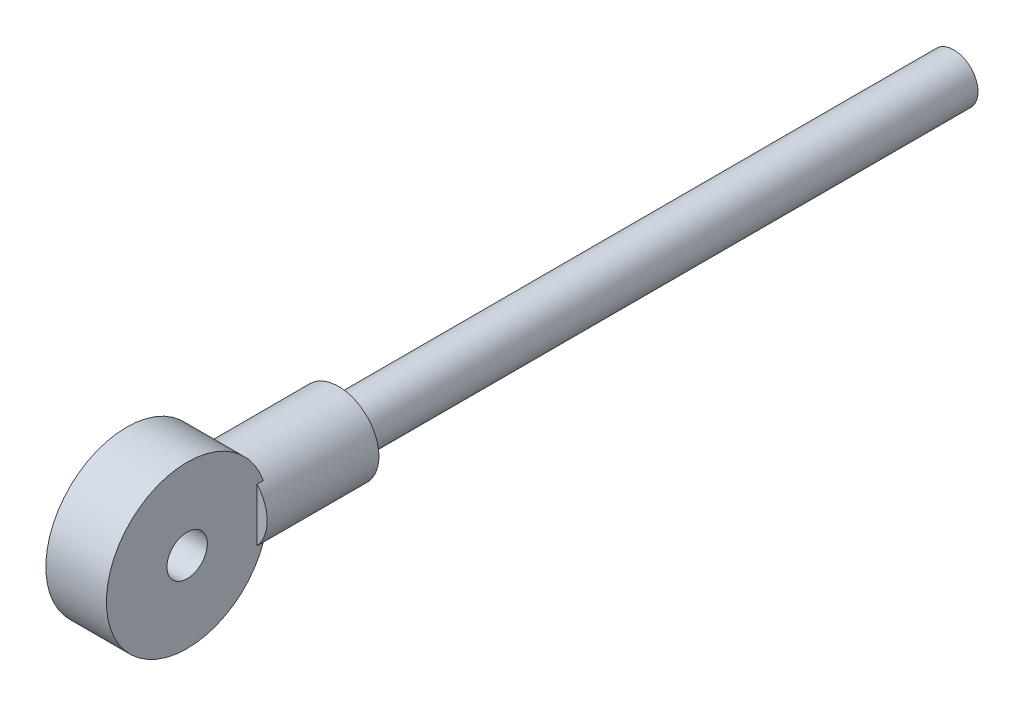
ISO-10303-21;
HEADER;
FILE_DESCRIPTION(('STEP AP214'),'2;1');
FILE_NAME('part.step','',(''),(''),'','','');
FILE_SCHEMA(('AUTOMOTIVE_DESIGN { 1 0 10303 214 1 1 1 1 }'));
ENDSEC;
DATA;
#1=APPLICATION_CONTEXT('core data for automotive mechanical design processes');
#2=APPLICATION_PROTOCOL_DEFINITION('international standard','automotive_design',2000,#1);
#3=PRODUCT_CONTEXT('',#1,'mechanical');
#4=PRODUCT('Part','Part','',(#3));
#5=PRODUCT_RELATED_PRODUCT_CATEGORY('part','',(#4));
#6=PRODUCT_DEFINITION_FORMATION('','',#4);
#7=PRODUCT_DEFINITION_CONTEXT('part definition',#1,'design');
#8=PRODUCT_DEFINITION('design','',#6,#7);
#9=PRODUCT_DEFINITION_SHAPE('','',#8);
#10=(LENGTH_UNIT() NAMED_UNIT(*) SI_UNIT(.MILLI.,.METRE.));
#11=(NAMED_UNIT(*) PLANE_ANGLE_UNIT() SI_UNIT($,.RADIAN.));
#12=(NAMED_UNIT(*) SI_UNIT($,.STERADIAN.) SOLID_ANGLE_UNIT());
#13=UNCERTAINTY_MEASURE_WITH_UNIT(LENGTH_MEASURE(1.E-05),#10,'distance_accuracy_value','');
#14=(GEOMETRIC_REPRESENTATION_CONTEXT(3) GLOBAL_UNCERTAINTY_ASSIGNED_CONTEXT((#13)) GLOBAL_UNIT_ASSIGNED_CONTEXT((#10,
#11,#12)) REPRESENTATION_CONTEXT('',''));
#15=CARTESIAN_POINT('',(0.,0.,0.));
#16=DIRECTION('',(0.,0.,1.));
#17=DIRECTION('',(1.,0.,0.));
#18=AXIS2_PLACEMENT_3D('',#15,#16,#17);
#19=CARTESIAN_POINT('',(0.,0.,150.22094174335));
#20=DIRECTION('',(0.,0.,1.));
#21=DIRECTION('',(0.,-1.,0.));
#22=AXIS2_PLACEMENT_3D('',#19,#20,#21);
#23=CYLINDRICAL_SURFACE('',#22,2.99999999999998);
#24=DIRECTION('',(0.,0.,1.));
#25=VECTOR('',#24,1.);
#26=CARTESIAN_POINT('',(2.25,1.98431348329841,150.22094174335));
#27=LINE('',#26,#25);
#28=CARTESIAN_POINT('',(2.25,1.98431348329841,158.524789320643));
#29=VERTEX_POINT('',#28);
#30=CARTESIAN_POINT('',(2.25,1.98431348329842,158.058565916897));
#31=VERTEX_POINT('',#30);
#32=EDGE_CURVE('E93',#29,#31,#27,.F.);
#33=ORIENTED_EDGE('',*,*,#32,.F.);
#34=CARTESIAN_POINT('',(0.,0.,158.524789320643));
#35=DIRECTION('',(0.,0.,1.));
#36=DIRECTION('',(0.,-1.,0.));
#37=AXIS2_PLACEMENT_3D('',#34,#35,#36);
#38=CIRCLE('',#37,2.99999999999998);
#39=CARTESIAN_POINT('',(2.25,-1.98431348329841,158.524789320643));
#40=VERTEX_POINT('',#39);
#41=EDGE_CURVE('E254',#40,#29,#38,.T.);
#42=ORIENTED_EDGE('',*,*,#41,.F.);
#43=DIRECTION('',(0.,0.,1.));
#44=VECTOR('',#43,1.);
#45=CARTESIAN_POINT('',(2.25,-1.98431348329841,150.22094174335));
#46=LINE('',#45,#44);
#47=CARTESIAN_POINT('',(2.25,-1.98431348329841,158.058565916897));
#48=VERTEX_POINT('',#47);
#49=EDGE_CURVE('E108',#48,#40,#46,.T.);
#50=ORIENTED_EDGE('',*,*,#49,.F.);
#51=CARTESIAN_POINT('',(2.25,-1.98431348329841,158.058565916897));
#52=CARTESIAN_POINT('',(2.13816063704798,-2.11108516363985,158.102941091746));
#53=CARTESIAN_POINT('',(2.01588160066686,-2.22815952458,158.148804685193));
#54=CARTESIAN_POINT('',(1.75208272835814,-2.44114953523773,158.238778655023));
#55=CARTESIAN_POINT('',(1.61043780861579,-2.53691602089613,158.282875002241));
#56=CARTESIAN_POINT('',(1.3107287042693,-2.70396042085879,158.363953383334));
#57=CARTESIAN_POINT('',(1.15262111448042,-2.77517134892929,158.400915837421));
#58=CARTESIAN_POINT('',(0.906910245268827,-2.86095007213829,158.446854614653));
#59=CARTESIAN_POINT('',(0.823726308302178,-2.88601253409324,158.460568516969));
#60=CARTESIAN_POINT('',(0.655019686419035,-2.92890881543682,158.484330179007));
#61=CARTESIAN_POINT('',(0.56949837443352,-2.94674678492574,158.494380043201));
#62=CARTESIAN_POINT('',(0.403586827598561,-2.97382336947511,158.509742626553));
#63=CARTESIAN_POINT('',(0.323316154990017,-2.9836238354249,158.515363496654));
#64=CARTESIAN_POINT('',(0.162030699641896,-2.99671381647977,158.522887856506));
#65=CARTESIAN_POINT('',(0.0810156013770706,-3.00000042944225,158.524789689293));
#66=CARTESIAN_POINT('',(-0.0782248221161793,-2.99999958535089,158.524788964692));
#67=CARTESIAN_POINT('',(-0.156450113279761,-2.9969346881355,158.523015202004));
#68=CARTESIAN_POINT('',(-0.312277007137009,-2.98472853342182,158.515998243143));
#69=CARTESIAN_POINT('',(-0.389878358684429,-2.97558494203082,158.510753714386));
#70=CARTESIAN_POINT('',(-0.621007960929015,-2.93915396988956,158.490051339408));
#71=CARTESIAN_POINT('',(-0.772783621248346,-2.90286654123617,158.469624981086));
#72=CARTESIAN_POINT('',(-1.06638611917204,-2.80830273320203,158.41846552981));
#73=CARTESIAN_POINT('',(-1.20825963322721,-2.75013913567999,158.387785388761));
#74=CARTESIAN_POINT('',(-1.48026566040241,-2.6137989458878,158.319659675073));
#75=CARTESIAN_POINT('',(-1.61039705190612,-2.53562044451018,158.282213457157));
#76=CARTESIAN_POINT('',(-1.82853332195372,-2.38118139543784,158.213184571525));
#77=CARTESIAN_POINT('',(-1.91936200799324,-2.30857934589531,158.182222185438));
#78=CARTESIAN_POINT('',(-2.09174028463982,-2.15360157841686,158.120139710362));
#79=CARTESIAN_POINT('',(-2.17331347630866,-2.07125186589232,158.089020243945));
#80=CARTESIAN_POINT('',(-2.25,-1.98431348329841,158.058565916897));
#81=B_SPLINE_CURVE_WITH_KNOTS('',3,(#51,#52,#53,#54,#55,#56,#57,#58,#59,#60,#61,#62,#63,#64,#65,
#66,#67,#68,#69,#70,#71,#72,#73,#74,#75,#76,#77,#78,#79,#80),.UNSPECIFIED.,.F.,.F.,(4,2,2,2,2,2,
2,2,2,2,2,2,2,2,4),(0.,0.523806767405271,1.05117245771471,1.57996559849132,1.84349191439982,
2.10686663250718,2.3497149881904,2.59267151675817,2.82725881730433,3.06193623885689,
3.53152216837908,3.99871962856722,4.46596166866854,4.82623354034363,5.18556504691816),.UNSPECIFIED.);
#82=CARTESIAN_POINT('',(-2.25,-1.98431348329841,158.058565916897));
#83=VERTEX_POINT('',#82);
#84=EDGE_CURVE('E92',#48,#83,#81,.T.);
#85=ORIENTED_EDGE('',*,*,#84,.T.);
#86=DIRECTION('',(0.,0.,1.));
#87=VECTOR('',#86,1.);
#88=CARTESIAN_POINT('',(-2.25,-1.98431348329841,150.22094174335));
#89=LINE('',#88,#87);
#90=CARTESIAN_POINT('',(-2.25,-1.98431348329841,158.524789320643));
#91=VERTEX_POINT('',#90);
#92=EDGE_CURVE('E99',#83,#91,#89,.T.);
#93=ORIENTED_EDGE('',*,*,#92,.T.);
#94=CARTESIAN_POINT('',(-2.25,1.98431348329841,158.524789320643));
#95=VERTEX_POINT('',#94);
#96=EDGE_CURVE('E106',#95,#91,#38,.T.);
#97=ORIENTED_EDGE('',*,*,#96,.F.);
#98=DIRECTION('',(0.,0.,1.));
#99=VECTOR('',#98,1.);
#100=CARTESIAN_POINT('',(-2.25,1.98431348329841,150.22094174335));
#101=LINE('',#100,#99);
#102=CARTESIAN_POINT('',(-2.25,1.98431348329842,158.058565916897));
#103=VERTEX_POINT('',#102);
#104=EDGE_CURVE('E59',#95,#103,#101,.F.);
#105=ORIENTED_EDGE('',*,*,#104,.T.);
#106=CARTESIAN_POINT('',(-2.25,1.98431348329842,158.058565916897));
#107=CARTESIAN_POINT('',(-2.13813666082812,2.11115030276203,158.1029648846));
#108=CARTESIAN_POINT('',(-2.01576042330965,2.22829091794647,158.148856819795));
#109=CARTESIAN_POINT('',(-1.75189912913121,2.44126393816147,158.238830337658));
#110=CARTESIAN_POINT('',(-1.61031025079419,2.53697251441181,158.282900257924));
#111=CARTESIAN_POINT('',(-1.31091321285402,2.70387221953942,158.363912742666));
#112=CARTESIAN_POINT('',(-1.15306805921839,2.77500574844844,158.400838474453));
#113=CARTESIAN_POINT('',(-0.825601526936578,2.88934481033802,158.462050143421));
#114=CARTESIAN_POINT('',(-0.656014670598736,2.93262866085221,158.4863714882));
#115=CARTESIAN_POINT('',(-0.324642703557551,2.98670582599644,158.517050236604));
#116=CARTESIAN_POINT('',(-0.163372950606527,2.99989096310937,158.524727405029));
#117=CARTESIAN_POINT('',(0.159220391880616,3.00010759988012,158.524850406589));
#118=CARTESIAN_POINT('',(0.320543981913048,2.98713885137636,158.517296095199));
#119=CARTESIAN_POINT('',(0.623610975659732,2.93812611147971,158.489490261562));
#120=CARTESIAN_POINT('',(0.765822940975129,2.90422799392212,158.470422793717));
#121=CARTESIAN_POINT('',(1.04247229136281,2.81679187752137,158.423004331284));
#122=CARTESIAN_POINT('',(1.17690477173086,2.7632416415395,158.394647553538));
#123=CARTESIAN_POINT('',(1.44505950073326,2.6335554551026,158.329278742294));
#124=CARTESIAN_POINT('',(1.57799259653398,2.55604108746532,158.291781405672));
#125=CARTESIAN_POINT('',(1.82968118784103,2.38235535403617,158.213363961928));
#126=CARTESIAN_POINT('',(1.94845189493592,2.28620430252957,158.172447608969));
#127=CARTESIAN_POINT('',(2.12577521481116,2.11883432839665,158.107107353027));
#128=CARTESIAN_POINT('',(2.18943766564424,2.05298796258887,158.082620984486));
#129=CARTESIAN_POINT('',(2.25,1.98431348329841,158.058565916897));
#130=B_SPLINE_CURVE_WITH_KNOTS('',3,(#106,#107,#108,#109,#110,#111,#112,#113,#114,#115,#116,
#117,#118,#119,#120,#121,#122,#123,#124,#125,#126,#127,#128,#129),.UNSPECIFIED.,.F.,.F.,(4,2,2,
2,2,2,2,2,2,2,2,4),(0.,0.524109137853362,1.05117249748309,1.57946295879476,2.10626121767092,
2.58947483454299,3.07269303641705,3.51310566325874,3.95379299638218,4.42710067391626,
4.89989531067902,5.1839250692978),.UNSPECIFIED.);
#131=EDGE_CURVE('E85',#103,#31,#130,.T.);
#132=ORIENTED_EDGE('',*,*,#131,.T.);
#133=EDGE_LOOP('',(#33,#42,#50,#85,#93,#97,#105,#132));
#134=FACE_BOUND('',#133,.T.);
#135=CARTESIAN_POINT('',(0.,0.,150.22094174335));
#136=DIRECTION('',(0.,0.,1.));
#137=DIRECTION('',(0.,-1.,0.));
#138=AXIS2_PLACEMENT_3D('',#135,#136,#137);
#139=CIRCLE('',#138,2.99999999999998);
#140=CARTESIAN_POINT('',(0.,-2.99999999999998,150.22094174335));
#141=VERTEX_POINT('',#140);
#142=EDGE_CURVE('E256',#141,#141,#139,.T.);
#143=ORIENTED_EDGE('',*,*,#142,.T.);
#144=EDGE_LOOP('',(#143));
#145=FACE_BOUND('',#144,.T.);
#146=ADVANCED_FACE('F43',(#134,#145),#23,.T.);
#147=CARTESIAN_POINT('',(0.,0.,158.524789320643));
#148=DIRECTION('',(0.,0.,1.));
#149=DIRECTION('',(0.,-1.,0.));
#150=AXIS2_PLACEMENT_3D('',#147,#148,#149);
#151=PLANE('',#150);
#152=ORIENTED_EDGE('',*,*,#96,.T.);
#153=DIRECTION('',(0.,1.,0.));
#154=VECTOR('',#153,1.);
#155=CARTESIAN_POINT('',(-2.25,0.,158.524789320643));
#156=LINE('',#155,#154);
#157=EDGE_CURVE('E52',#91,#95,#156,.T.);
#158=ORIENTED_EDGE('',*,*,#157,.T.);
#159=EDGE_LOOP('',(#152,#158));
#160=FACE_BOUND('',#159,.T.);
#161=ADVANCED_FACE('F143',(#160),#151,.T.);
#162=CARTESIAN_POINT('',(0.,0.,104.5));
#163=DIRECTION('',(0.,0.,1.));
#164=DIRECTION('',(0.,-1.,0.));
#165=AXIS2_PLACEMENT_3D('',#162,#163,#164);
#166=PLANE('',#165);
#167=CARTESIAN_POINT('',(0.,0.,104.5));
#168=DIRECTION('',(0.,0.,1.));
#169=DIRECTION('',(0.,-1.,0.));
#170=AXIS2_PLACEMENT_3D('',#167,#168,#169);
#171=CIRCLE('',#170,1.80000000000001);
#172=CARTESIAN_POINT('',(0.,-1.80000000000002,104.5));
#173=VERTEX_POINT('',#172);
#174=EDGE_CURVE('E266',#173,#173,#171,.T.);
#175=ORIENTED_EDGE('',*,*,#174,.F.);
#176=EDGE_LOOP('',(#175));
#177=FACE_BOUND('',#176,.T.);
#178=ADVANCED_FACE('F45',(#177),#166,.F.);
#179=CARTESIAN_POINT('',(0.,0.,150.22094174335));
#180=DIRECTION('',(0.,0.,1.));
#181=DIRECTION('',(0.,-1.,0.));
#182=AXIS2_PLACEMENT_3D('',#179,#180,#181);
#183=CYLINDRICAL_SURFACE('',#182,1.80000000000001);
#184=ORIENTED_EDGE('',*,*,#174,.T.);
#185=EDGE_LOOP('',(#184));
#186=FACE_BOUND('',#185,.T.);
#187=CARTESIAN_POINT('',(0.,0.,150.22094174335));
#188=DIRECTION('',(0.,0.,1.));
#189=DIRECTION('',(0.,-1.,0.));
#190=AXIS2_PLACEMENT_3D('',#187,#188,#189);
#191=CIRCLE('',#190,1.8);
#192=CARTESIAN_POINT('',(0.,-1.8,150.22094174335));
#193=VERTEX_POINT('',#192);
#194=EDGE_CURVE('E260',#193,#193,#191,.T.);
#195=ORIENTED_EDGE('',*,*,#194,.F.);
#196=EDGE_LOOP('',(#195));
#197=FACE_BOUND('',#196,.T.);
#198=ADVANCED_FACE('F147',(#186,#197),#183,.T.);
#199=CARTESIAN_POINT('',(0.,0.,150.22094174335));
#200=DIRECTION('',(0.,0.,1.));
#201=DIRECTION('',(0.,-1.,0.));
#202=AXIS2_PLACEMENT_3D('',#199,#200,#201);
#203=PLANE('',#202);
#204=ORIENTED_EDGE('',*,*,#142,.F.);
#205=EDGE_LOOP('',(#204));
#206=FACE_BOUND('',#205,.T.);
#207=ORIENTED_EDGE('',*,*,#194,.T.);
#208=EDGE_LOOP('',(#207));
#209=FACE_BOUND('',#208,.T.);
#210=ADVANCED_FACE('F141',(#206,#209),#203,.F.);
#211=DIRECTION('',(0.,1.,0.));
#212=VECTOR('',#211,1.);
#213=CARTESIAN_POINT('',(2.25,0.,158.524789320643));
#214=LINE('',#213,#212);
#215=EDGE_CURVE('E11',#40,#29,#214,.T.);
#216=ORIENTED_EDGE('',*,*,#215,.F.);
#217=ORIENTED_EDGE('',*,*,#41,.T.);
#218=EDGE_LOOP('',(#216,#217));
#219=FACE_BOUND('',#218,.T.);
#220=ADVANCED_FACE('F137',(#219),#151,.T.);
#221=CARTESIAN_POINT('',(2.25,0.,163.72094174335));
#222=DIRECTION('',(-1.,0.,0.));
#223=DIRECTION('',(0.,0.,1.));
#224=AXIS2_PLACEMENT_3D('',#221,#222,#223);
#225=CYLINDRICAL_SURFACE('',#224,6.00000000000002);
#226=CARTESIAN_POINT('',(-2.25,0.,163.72094174335));
#227=DIRECTION('',(1.,0.,0.));
#228=DIRECTION('',(0.,0.,-1.));
#229=AXIS2_PLACEMENT_3D('',#226,#227,#228);
#230=CIRCLE('',#229,6.00000000000002);
#231=EDGE_CURVE('E87',#103,#83,#230,.T.);
#232=ORIENTED_EDGE('',*,*,#231,.T.);
#233=ORIENTED_EDGE('',*,*,#84,.F.);
#234=CARTESIAN_POINT('',(2.25,0.,163.72094174335));
#235=DIRECTION('',(1.,0.,0.));
#236=DIRECTION('',(0.,0.,-1.));
#237=AXIS2_PLACEMENT_3D('',#234,#235,#236);
#238=CIRCLE('',#237,6.00000000000002);
#239=EDGE_CURVE('E89',#31,#48,#238,.T.);
#240=ORIENTED_EDGE('',*,*,#239,.F.);
#241=ORIENTED_EDGE('',*,*,#131,.F.);
#242=EDGE_LOOP('',(#232,#233,#240,#241));
#243=FACE_BOUND('',#242,.T.);
#244=ADVANCED_FACE('F86',(#243),#225,.T.);
#245=CARTESIAN_POINT('',(2.25,0.,163.72094174335));
#246=DIRECTION('',(-1.,0.,0.));
#247=DIRECTION('',(0.,0.,1.));
#248=AXIS2_PLACEMENT_3D('',#245,#246,#247);
#249=CYLINDRICAL_SURFACE('',#248,1.5);
#250=CARTESIAN_POINT('',(2.25,0.,163.72094174335));
#251=DIRECTION('',(1.,0.,0.));
#252=DIRECTION('',(0.,0.,-1.));
#253=AXIS2_PLACEMENT_3D('',#250,#251,#252);
#254=CIRCLE('',#253,1.5);
#255=CARTESIAN_POINT('',(2.25,0.,162.22094174335));
#256=VERTEX_POINT('',#255);
#257=EDGE_CURVE('E113',#256,#256,#254,.T.);
#258=ORIENTED_EDGE('',*,*,#257,.T.);
#259=EDGE_LOOP('',(#258));
#260=FACE_BOUND('',#259,.T.);
#261=CARTESIAN_POINT('',(-2.25,0.,163.72094174335));
#262=DIRECTION('',(1.,0.,0.));
#263=DIRECTION('',(0.,0.,-1.));
#264=AXIS2_PLACEMENT_3D('',#261,#262,#263);
#265=CIRCLE('',#264,1.5);
#266=CARTESIAN_POINT('',(-2.25,0.,162.22094174335));
#267=VERTEX_POINT('',#266);
#268=EDGE_CURVE('E101',#267,#267,#265,.T.);
#269=ORIENTED_EDGE('',*,*,#268,.F.);
#270=EDGE_LOOP('',(#269));
#271=FACE_BOUND('',#270,.T.);
#272=ADVANCED_FACE('F136',(#260,#271),#249,.F.);
#273=CARTESIAN_POINT('',(2.25,0.,0.));
#274=DIRECTION('',(1.,0.,0.));
#275=DIRECTION('',(0.,0.,-1.));
#276=AXIS2_PLACEMENT_3D('',#273,#274,#275);
#277=PLANE('',#276);
#278=ORIENTED_EDGE('',*,*,#215,.T.);
#279=ORIENTED_EDGE('',*,*,#32,.T.);
#280=ORIENTED_EDGE('',*,*,#239,.T.);
#281=ORIENTED_EDGE('',*,*,#49,.T.);
#282=EDGE_LOOP('',(#278,#279,#280,#281));
#283=FACE_BOUND('',#282,.T.);
#284=ORIENTED_EDGE('',*,*,#257,.F.);
#285=EDGE_LOOP('',(#284));
#286=FACE_BOUND('',#285,.T.);
#287=ADVANCED_FACE('F200',(#283,#286),#277,.T.);
#288=CARTESIAN_POINT('',(-2.25,0.,0.));
#289=DIRECTION('',(1.,0.,0.));
#290=DIRECTION('',(0.,0.,-1.));
#291=AXIS2_PLACEMENT_3D('',#288,#289,#290);
#292=PLANE('',#291);
#293=ORIENTED_EDGE('',*,*,#104,.F.);
#294=ORIENTED_EDGE('',*,*,#157,.F.);
#295=ORIENTED_EDGE('',*,*,#92,.F.);
#296=ORIENTED_EDGE('',*,*,#231,.F.);
#297=EDGE_LOOP('',(#293,#294,#295,#296));
#298=FACE_BOUND('',#297,.T.);
#299=ORIENTED_EDGE('',*,*,#268,.T.);
#300=EDGE_LOOP('',(#299));
#301=FACE_BOUND('',#300,.T.);
#302=ADVANCED_FACE('F96',(#298,#301),#292,.F.);
#303=CLOSED_SHELL('',(#146,#161,#178,#198,#210,#220,#244,#272,#287,#302));
#304=MANIFOLD_SOLID_BREP('B2',#303);
#305=ADVANCED_BREP_SHAPE_REPRESENTATION('',(#18,#304),#14);
#306=SHAPE_DEFINITION_REPRESENTATION(#9,#305);
ENDSEC;
END-ISO-10303-21;
